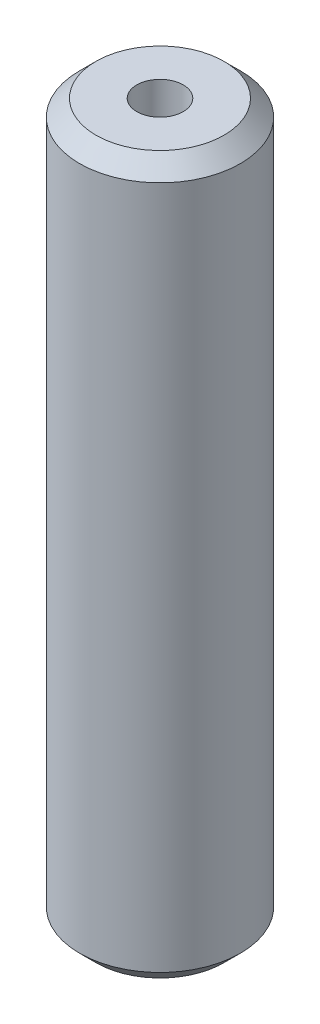
ISO-10303-21;
HEADER;
FILE_DESCRIPTION(('STEP AP214'),'2;1');
FILE_NAME('part.step','',(''),(''),'','','');
FILE_SCHEMA(('AUTOMOTIVE_DESIGN { 1 0 10303 214 1 1 1 1 }'));
ENDSEC;
DATA;
#1=APPLICATION_CONTEXT('core data for automotive mechanical design processes');
#2=APPLICATION_PROTOCOL_DEFINITION('international standard','automotive_design',2000,#1);
#3=PRODUCT_CONTEXT('',#1,'mechanical');
#4=PRODUCT('Part','Part','',(#3));
#5=PRODUCT_RELATED_PRODUCT_CATEGORY('part','',(#4));
#6=PRODUCT_DEFINITION_FORMATION('','',#4);
#7=PRODUCT_DEFINITION_CONTEXT('part definition',#1,'design');
#8=PRODUCT_DEFINITION('design','',#6,#7);
#9=PRODUCT_DEFINITION_SHAPE('','',#8);
#10=(LENGTH_UNIT() NAMED_UNIT(*) SI_UNIT(.MILLI.,.METRE.));
#11=(NAMED_UNIT(*) PLANE_ANGLE_UNIT() SI_UNIT($,.RADIAN.));
#12=(NAMED_UNIT(*) SI_UNIT($,.STERADIAN.) SOLID_ANGLE_UNIT());
#13=UNCERTAINTY_MEASURE_WITH_UNIT(LENGTH_MEASURE(1.E-05),#10,'distance_accuracy_value','');
#14=(GEOMETRIC_REPRESENTATION_CONTEXT(3) GLOBAL_UNCERTAINTY_ASSIGNED_CONTEXT((#13)) GLOBAL_UNIT_ASSIGNED_CONTEXT((#10,
#11,#12)) REPRESENTATION_CONTEXT('',''));
#15=CARTESIAN_POINT('',(0.,0.,0.));
#16=DIRECTION('',(0.,0.,1.));
#17=DIRECTION('',(1.,0.,0.));
#18=AXIS2_PLACEMENT_3D('',#15,#16,#17);
#19=CARTESIAN_POINT('',(0.,44.557233752063,0.));
#20=DIRECTION('',(0.,-1.,0.));
#21=DIRECTION('',(0.,0.,-1.));
#22=AXIS2_PLACEMENT_3D('',#19,#20,#21);
#23=CYLINDRICAL_SURFACE('',#22,5.);
#24=CARTESIAN_POINT('',(0.,43.538182234012,0.));
#25=DIRECTION('',(0.,1.,0.));
#26=DIRECTION('',(0.,0.,1.));
#27=AXIS2_PLACEMENT_3D('',#24,#25,#26);
#28=CIRCLE('',#27,5.);
#29=CARTESIAN_POINT('',(0.,43.538182234012,5.));
#30=VERTEX_POINT('',#29);
#31=EDGE_CURVE('E50',#30,#30,#28,.F.);
#32=ORIENTED_EDGE('',*,*,#31,.T.);
#33=EDGE_LOOP('',(#32));
#34=FACE_BOUND('',#33,.T.);
#35=CARTESIAN_POINT('',(0.,1.01905151805101,0.));
#36=DIRECTION('',(0.,1.,0.));
#37=DIRECTION('',(0.,0.,1.));
#38=AXIS2_PLACEMENT_3D('',#35,#36,#37);
#39=CIRCLE('',#38,5.);
#40=CARTESIAN_POINT('',(0.,1.01905151805101,5.));
#41=VERTEX_POINT('',#40);
#42=EDGE_CURVE('E51',#41,#41,#39,.T.);
#43=ORIENTED_EDGE('',*,*,#42,.T.);
#44=EDGE_LOOP('',(#43));
#45=FACE_BOUND('',#44,.T.);
#46=ADVANCED_FACE('F39',(#34,#45),#23,.T.);
#47=CARTESIAN_POINT('',(0.,44.557233752063,0.));
#48=DIRECTION('',(0.,1.,0.));
#49=DIRECTION('',(0.,0.,1.));
#50=AXIS2_PLACEMENT_3D('',#47,#48,#49);
#51=PLANE('',#50);
#52=CARTESIAN_POINT('',(0.,44.557233752063,0.));
#53=DIRECTION('',(0.,1.,0.));
#54=DIRECTION('',(0.,0.,1.));
#55=AXIS2_PLACEMENT_3D('',#52,#53,#54);
#56=CIRCLE('',#55,3.98094848194899);
#57=CARTESIAN_POINT('',(0.,44.557233752063,3.98094848194899));
#58=VERTEX_POINT('',#57);
#59=EDGE_CURVE('E54',#58,#58,#56,.T.);
#60=ORIENTED_EDGE('',*,*,#59,.T.);
#61=EDGE_LOOP('',(#60));
#62=FACE_BOUND('',#61,.T.);
#63=CARTESIAN_POINT('',(0.,44.557233752063,0.));
#64=DIRECTION('',(0.,1.,0.));
#65=DIRECTION('',(0.,0.,1.));
#66=AXIS2_PLACEMENT_3D('',#63,#64,#65);
#67=CIRCLE('',#66,1.44350004802628);
#68=CARTESIAN_POINT('',(0.,44.557233752063,1.44350004802628));
#69=VERTEX_POINT('',#68);
#70=EDGE_CURVE('E58',#69,#69,#67,.T.);
#71=ORIENTED_EDGE('',*,*,#70,.F.);
#72=EDGE_LOOP('',(#71));
#73=FACE_BOUND('',#72,.T.);
#74=ADVANCED_FACE('F69',(#62,#73),#51,.T.);
#75=CARTESIAN_POINT('',(0.,0.,0.));
#76=DIRECTION('',(0.,1.,0.));
#77=DIRECTION('',(0.,0.,1.));
#78=AXIS2_PLACEMENT_3D('',#75,#76,#77);
#79=PLANE('',#78);
#80=CARTESIAN_POINT('',(0.,0.,0.));
#81=DIRECTION('',(0.,1.,0.));
#82=DIRECTION('',(0.,0.,1.));
#83=AXIS2_PLACEMENT_3D('',#80,#81,#82);
#84=CIRCLE('',#83,3.98094848194898);
#85=CARTESIAN_POINT('',(0.,0.,3.98094848194898));
#86=VERTEX_POINT('',#85);
#87=EDGE_CURVE('E10',#86,#86,#84,.F.);
#88=ORIENTED_EDGE('',*,*,#87,.T.);
#89=EDGE_LOOP('',(#88));
#90=FACE_BOUND('',#89,.T.);
#91=CARTESIAN_POINT('',(0.,0.,0.));
#92=DIRECTION('',(0.,1.,0.));
#93=DIRECTION('',(0.,0.,1.));
#94=AXIS2_PLACEMENT_3D('',#91,#92,#93);
#95=CIRCLE('',#94,1.44350004802628);
#96=CARTESIAN_POINT('',(0.,0.,1.44350004802628));
#97=VERTEX_POINT('',#96);
#98=EDGE_CURVE('E63',#97,#97,#95,.T.);
#99=ORIENTED_EDGE('',*,*,#98,.T.);
#100=EDGE_LOOP('',(#99));
#101=FACE_BOUND('',#100,.T.);
#102=ADVANCED_FACE('F75',(#90,#101),#79,.F.);
#103=CARTESIAN_POINT('',(0.,44.557233752063,0.));
#104=DIRECTION('',(0.,-1.,0.));
#105=DIRECTION('',(0.,0.,-1.));
#106=AXIS2_PLACEMENT_3D('',#103,#104,#105);
#107=CYLINDRICAL_SURFACE('',#106,1.44350004802628);
#108=ORIENTED_EDGE('',*,*,#70,.T.);
#109=EDGE_LOOP('',(#108));
#110=FACE_BOUND('',#109,.T.);
#111=ORIENTED_EDGE('',*,*,#98,.F.);
#112=EDGE_LOOP('',(#111));
#113=FACE_BOUND('',#112,.T.);
#114=ADVANCED_FACE('F70',(#110,#113),#107,.F.);
#115=CARTESIAN_POINT('',(0.,44.557233752063,0.));
#116=DIRECTION('',(0.,-1.,0.));
#117=DIRECTION('',(0.,0.,-1.));
#118=AXIS2_PLACEMENT_3D('',#115,#116,#117);
#119=CONICAL_SURFACE('',#118,3.98094848194899,0.785398163397446);
#120=ORIENTED_EDGE('',*,*,#31,.F.);
#121=EDGE_LOOP('',(#120));
#122=FACE_BOUND('',#121,.T.);
#123=ORIENTED_EDGE('',*,*,#59,.F.);
#124=EDGE_LOOP('',(#123));
#125=FACE_BOUND('',#124,.T.);
#126=ADVANCED_FACE('F81',(#122,#125),#119,.T.);
#127=CARTESIAN_POINT('',(0.,1.01905151805101,0.));
#128=DIRECTION('',(0.,1.,0.));
#129=DIRECTION('',(0.,0.,1.));
#130=AXIS2_PLACEMENT_3D('',#127,#128,#129);
#131=CONICAL_SURFACE('',#130,5.,0.785398163397453);
#132=ORIENTED_EDGE('',*,*,#87,.F.);
#133=EDGE_LOOP('',(#132));
#134=FACE_BOUND('',#133,.T.);
#135=ORIENTED_EDGE('',*,*,#42,.F.);
#136=EDGE_LOOP('',(#135));
#137=FACE_BOUND('',#136,.T.);
#138=ADVANCED_FACE('F45',(#134,#137),#131,.T.);
#139=CLOSED_SHELL('',(#46,#74,#102,#114,#126,#138));
#140=MANIFOLD_SOLID_BREP('B2',#139);
#141=ADVANCED_BREP_SHAPE_REPRESENTATION('',(#18,#140),#14);
#142=SHAPE_DEFINITION_REPRESENTATION(#9,#141);
ENDSEC;
END-ISO-10303-21;
